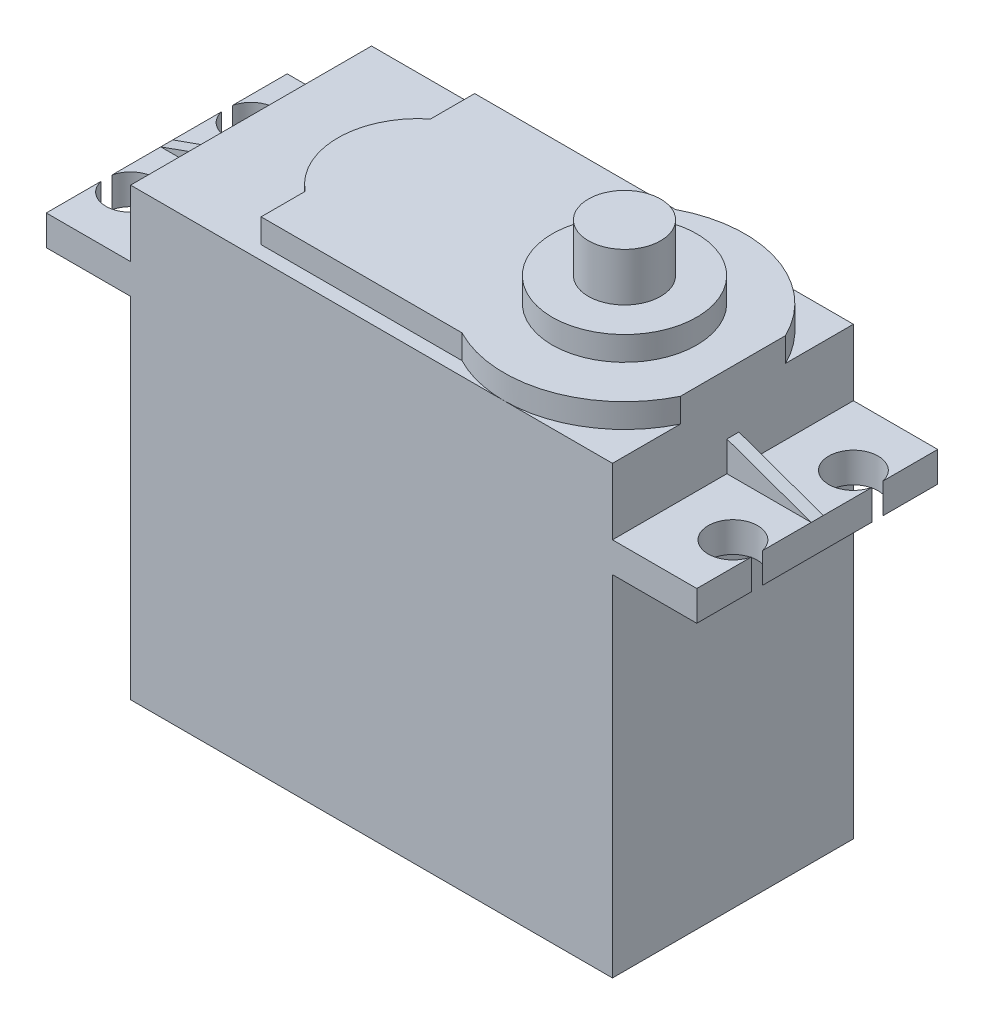
ISO-10303-21;
HEADER;
FILE_DESCRIPTION(('STEP AP214'),'2;1');
FILE_NAME('part.step','',(''),(''),'','','');
FILE_SCHEMA(('AUTOMOTIVE_DESIGN { 1 0 10303 214 1 1 1 1 }'));
ENDSEC;
DATA;
#1=APPLICATION_CONTEXT('core data for automotive mechanical design processes');
#2=APPLICATION_PROTOCOL_DEFINITION('international standard','automotive_design',2000,#1);
#3=PRODUCT_CONTEXT('',#1,'mechanical');
#4=PRODUCT('Part','Part','',(#3));
#5=PRODUCT_RELATED_PRODUCT_CATEGORY('part','',(#4));
#6=PRODUCT_DEFINITION_FORMATION('','',#4);
#7=PRODUCT_DEFINITION_CONTEXT('part definition',#1,'design');
#8=PRODUCT_DEFINITION('design','',#6,#7);
#9=PRODUCT_DEFINITION_SHAPE('','',#8);
#10=(LENGTH_UNIT() NAMED_UNIT(*) SI_UNIT(.MILLI.,.METRE.));
#11=(NAMED_UNIT(*) PLANE_ANGLE_UNIT() SI_UNIT($,.RADIAN.));
#12=(NAMED_UNIT(*) SI_UNIT($,.STERADIAN.) SOLID_ANGLE_UNIT());
#13=UNCERTAINTY_MEASURE_WITH_UNIT(LENGTH_MEASURE(1.E-05),#10,'distance_accuracy_value','');
#14=(GEOMETRIC_REPRESENTATION_CONTEXT(3) GLOBAL_UNCERTAINTY_ASSIGNED_CONTEXT((#13)) GLOBAL_UNIT_ASSIGNED_CONTEXT((#10,
#11,#12)) REPRESENTATION_CONTEXT('',''));
#15=CARTESIAN_POINT('',(0.,0.,0.));
#16=DIRECTION('',(0.,0.,1.));
#17=DIRECTION('',(1.,0.,0.));
#18=AXIS2_PLACEMENT_3D('',#15,#16,#17);
#19=CARTESIAN_POINT('',(0.,31.5,0.));
#20=DIRECTION('',(0.,-1.,0.));
#21=DIRECTION('',(0.,0.,-1.));
#22=AXIS2_PLACEMENT_3D('',#19,#20,#21);
#23=PLANE('',#22);
#24=DIRECTION('',(1.,0.,0.));
#25=VECTOR('',#24,1.);
#26=CARTESIAN_POINT('',(27.,31.5,0.5));
#27=LINE('',#26,#25);
#28=CARTESIAN_POINT('',(20.,31.5,0.5));
#29=VERTEX_POINT('',#28);
#30=CARTESIAN_POINT('',(27.,31.5,0.5));
#31=VERTEX_POINT('',#30);
#32=EDGE_CURVE('E284',#29,#31,#27,.T.);
#33=ORIENTED_EDGE('',*,*,#32,.F.);
#34=DIRECTION('',(0.,0.,-1.));
#35=VECTOR('',#34,1.);
#36=CARTESIAN_POINT('',(20.,31.5,10.));
#37=LINE('',#36,#35);
#38=CARTESIAN_POINT('',(20.,31.5,10.));
#39=VERTEX_POINT('',#38);
#40=EDGE_CURVE('E268',#39,#29,#37,.T.);
#41=ORIENTED_EDGE('',*,*,#40,.F.);
#42=DIRECTION('',(1.,0.,0.));
#43=VECTOR('',#42,1.);
#44=CARTESIAN_POINT('',(-27.,31.5,10.));
#45=LINE('',#44,#43);
#46=CARTESIAN_POINT('',(27.,31.5,10.));
#47=VERTEX_POINT('',#46);
#48=EDGE_CURVE('E533',#39,#47,#45,.T.);
#49=ORIENTED_EDGE('',*,*,#48,.T.);
#50=DIRECTION('',(0.,0.,-1.));
#51=VECTOR('',#50,1.);
#52=CARTESIAN_POINT('',(27.,31.5,10.));
#53=LINE('',#52,#51);
#54=CARTESIAN_POINT('',(27.,31.5,5.44999999999998));
#55=VERTEX_POINT('',#54);
#56=EDGE_CURVE('E518',#47,#55,#53,.T.);
#57=ORIENTED_EDGE('',*,*,#56,.T.);
#58=CARTESIAN_POINT('',(25.,31.5,5.));
#59=DIRECTION('',(0.,1.,0.));
#60=DIRECTION('',(0.,0.,1.));
#61=AXIS2_PLACEMENT_3D('',#58,#59,#60);
#62=CIRCLE('',#61,2.05);
#63=CARTESIAN_POINT('',(27.,31.5,4.55000000000002));
#64=VERTEX_POINT('',#63);
#65=EDGE_CURVE('E340',#64,#55,#62,.T.);
#66=ORIENTED_EDGE('',*,*,#65,.F.);
#67=EDGE_CURVE('E286',#64,#31,#53,.T.);
#68=ORIENTED_EDGE('',*,*,#67,.T.);
#69=EDGE_LOOP('',(#33,#41,#49,#57,#66,#68));
#70=FACE_BOUND('',#69,.T.);
#71=ADVANCED_FACE('F39',(#70),#23,.F.);
#72=DIRECTION('',(1.,0.,0.));
#73=VECTOR('',#72,1.);
#74=CARTESIAN_POINT('',(-27.,31.5,0.5));
#75=LINE('',#74,#73);
#76=CARTESIAN_POINT('',(-27.,31.5,0.5));
#77=VERTEX_POINT('',#76);
#78=CARTESIAN_POINT('',(-20.,31.5,0.5));
#79=VERTEX_POINT('',#78);
#80=EDGE_CURVE('E321',#77,#79,#75,.T.);
#81=ORIENTED_EDGE('',*,*,#80,.F.);
#82=DIRECTION('',(0.,0.,1.));
#83=VECTOR('',#82,1.);
#84=CARTESIAN_POINT('',(-27.,31.5,10.));
#85=LINE('',#84,#83);
#86=CARTESIAN_POINT('',(-27.,31.5,4.54999999999996));
#87=VERTEX_POINT('',#86);
#88=EDGE_CURVE('E535',#77,#87,#85,.T.);
#89=ORIENTED_EDGE('',*,*,#88,.T.);
#90=CARTESIAN_POINT('',(-25.,31.5,5.));
#91=DIRECTION('',(0.,1.,0.));
#92=DIRECTION('',(0.,0.,1.));
#93=AXIS2_PLACEMENT_3D('',#90,#91,#92);
#94=CIRCLE('',#93,2.05);
#95=CARTESIAN_POINT('',(-27.,31.5,5.45000000000004));
#96=VERTEX_POINT('',#95);
#97=EDGE_CURVE('E346',#96,#87,#94,.T.);
#98=ORIENTED_EDGE('',*,*,#97,.F.);
#99=CARTESIAN_POINT('',(-27.,31.5,10.));
#100=VERTEX_POINT('',#99);
#101=EDGE_CURVE('E528',#96,#100,#85,.T.);
#102=ORIENTED_EDGE('',*,*,#101,.T.);
#103=CARTESIAN_POINT('',(-20.,31.5,10.));
#104=VERTEX_POINT('',#103);
#105=EDGE_CURVE('E536',#100,#104,#45,.T.);
#106=ORIENTED_EDGE('',*,*,#105,.T.);
#107=DIRECTION('',(0.,0.,1.));
#108=VECTOR('',#107,1.);
#109=CARTESIAN_POINT('',(-20.,31.5,10.));
#110=LINE('',#109,#108);
#111=EDGE_CURVE('E280',#79,#104,#110,.T.);
#112=ORIENTED_EDGE('',*,*,#111,.F.);
#113=EDGE_LOOP('',(#81,#89,#98,#102,#106,#112));
#114=FACE_BOUND('',#113,.T.);
#115=ADVANCED_FACE('F693',(#114),#23,.F.);
#116=CARTESIAN_POINT('',(27.,31.5,10.));
#117=DIRECTION('',(-1.,0.,0.));
#118=DIRECTION('',(0.,0.,1.));
#119=AXIS2_PLACEMENT_3D('',#116,#117,#118);
#120=PLANE('',#119);
#121=DIRECTION('',(0.,0.,-1.));
#122=VECTOR('',#121,1.);
#123=CARTESIAN_POINT('',(27.,29.,10.));
#124=LINE('',#123,#122);
#125=CARTESIAN_POINT('',(27.,29.,4.55000000000002));
#126=VERTEX_POINT('',#125);
#127=CARTESIAN_POINT('',(27.,29.,-4.55000000000002));
#128=VERTEX_POINT('',#127);
#129=EDGE_CURVE('E546',#126,#128,#124,.T.);
#130=ORIENTED_EDGE('',*,*,#129,.T.);
#131=DIRECTION('',(0.,1.,0.));
#132=VECTOR('',#131,1.);
#133=CARTESIAN_POINT('',(27.,27.5,-4.55000000000002));
#134=LINE('',#133,#132);
#135=CARTESIAN_POINT('',(27.,31.5,-4.55000000000002));
#136=VERTEX_POINT('',#135);
#137=EDGE_CURVE('E11',#128,#136,#134,.T.);
#138=ORIENTED_EDGE('',*,*,#137,.T.);
#139=CARTESIAN_POINT('',(27.,31.5,-0.5));
#140=VERTEX_POINT('',#139);
#141=EDGE_CURVE('E523',#140,#136,#53,.T.);
#142=ORIENTED_EDGE('',*,*,#141,.F.);
#143=DIRECTION('',(0.,0.,1.));
#144=VECTOR('',#143,1.);
#145=CARTESIAN_POINT('',(27.,31.5,-0.5));
#146=LINE('',#145,#144);
#147=EDGE_CURVE('E62',#140,#31,#146,.T.);
#148=ORIENTED_EDGE('',*,*,#147,.T.);
#149=ORIENTED_EDGE('',*,*,#67,.F.);
#150=DIRECTION('',(0.,1.,0.));
#151=VECTOR('',#150,1.);
#152=CARTESIAN_POINT('',(27.,27.5,4.55000000000002));
#153=LINE('',#152,#151);
#154=EDGE_CURVE('E620',#64,#126,#153,.F.);
#155=ORIENTED_EDGE('',*,*,#154,.T.);
#156=EDGE_LOOP('',(#130,#138,#142,#148,#149,#155));
#157=FACE_BOUND('',#156,.T.);
#158=ADVANCED_FACE('F644',(#157),#120,.F.);
#159=CARTESIAN_POINT('',(27.,29.,10.));
#160=VERTEX_POINT('',#159);
#161=CARTESIAN_POINT('',(27.,29.,5.44999999999998));
#162=VERTEX_POINT('',#161);
#163=EDGE_CURVE('E541',#160,#162,#124,.T.);
#164=ORIENTED_EDGE('',*,*,#163,.T.);
#165=DIRECTION('',(0.,1.,0.));
#166=VECTOR('',#165,1.);
#167=CARTESIAN_POINT('',(27.,27.5,5.44999999999998));
#168=LINE('',#167,#166);
#169=EDGE_CURVE('E624',#162,#55,#168,.T.);
#170=ORIENTED_EDGE('',*,*,#169,.T.);
#171=ORIENTED_EDGE('',*,*,#56,.F.);
#172=DIRECTION('',(0.,-1.,0.));
#173=VECTOR('',#172,1.);
#174=CARTESIAN_POINT('',(27.,31.5,10.));
#175=LINE('',#174,#173);
#176=EDGE_CURVE('E540',#47,#160,#175,.T.);
#177=ORIENTED_EDGE('',*,*,#176,.T.);
#178=EDGE_LOOP('',(#164,#170,#171,#177));
#179=FACE_BOUND('',#178,.T.);
#180=ADVANCED_FACE('F650',(#179),#120,.F.);
#181=CARTESIAN_POINT('',(-27.,31.5,10.));
#182=DIRECTION('',(1.,0.,0.));
#183=DIRECTION('',(0.,0.,-1.));
#184=AXIS2_PLACEMENT_3D('',#181,#182,#183);
#185=PLANE('',#184);
#186=DIRECTION('',(0.,0.,1.));
#187=VECTOR('',#186,1.);
#188=CARTESIAN_POINT('',(-27.,29.,10.));
#189=LINE('',#188,#187);
#190=CARTESIAN_POINT('',(-27.,29.,-4.54999999999996));
#191=VERTEX_POINT('',#190);
#192=CARTESIAN_POINT('',(-27.,29.,4.54999999999996));
#193=VERTEX_POINT('',#192);
#194=EDGE_CURVE('E557',#191,#193,#189,.T.);
#195=ORIENTED_EDGE('',*,*,#194,.T.);
#196=DIRECTION('',(0.,1.,0.));
#197=VECTOR('',#196,1.);
#198=CARTESIAN_POINT('',(-27.,27.5,4.54999999999996));
#199=LINE('',#198,#197);
#200=EDGE_CURVE('E368',#193,#87,#199,.T.);
#201=ORIENTED_EDGE('',*,*,#200,.T.);
#202=ORIENTED_EDGE('',*,*,#88,.F.);
#203=DIRECTION('',(0.,0.,1.));
#204=VECTOR('',#203,1.);
#205=CARTESIAN_POINT('',(-27.,31.5,-0.5));
#206=LINE('',#205,#204);
#207=CARTESIAN_POINT('',(-27.,31.5,-0.5));
#208=VERTEX_POINT('',#207);
#209=EDGE_CURVE('E336',#208,#77,#206,.T.);
#210=ORIENTED_EDGE('',*,*,#209,.F.);
#211=CARTESIAN_POINT('',(-27.,31.5,-4.54999999999996));
#212=VERTEX_POINT('',#211);
#213=EDGE_CURVE('E534',#212,#208,#85,.T.);
#214=ORIENTED_EDGE('',*,*,#213,.F.);
#215=DIRECTION('',(0.,1.,0.));
#216=VECTOR('',#215,1.);
#217=CARTESIAN_POINT('',(-27.,27.5,-4.54999999999996));
#218=LINE('',#217,#216);
#219=EDGE_CURVE('E356',#212,#191,#218,.F.);
#220=ORIENTED_EDGE('',*,*,#219,.T.);
#221=EDGE_LOOP('',(#195,#201,#202,#210,#214,#220));
#222=FACE_BOUND('',#221,.T.);
#223=ADVANCED_FACE('F682',(#222),#185,.F.);
#224=CARTESIAN_POINT('',(-27.,29.,-10.));
#225=VERTEX_POINT('',#224);
#226=CARTESIAN_POINT('',(-27.,29.,-5.45000000000004));
#227=VERTEX_POINT('',#226);
#228=EDGE_CURVE('E552',#225,#227,#189,.T.);
#229=ORIENTED_EDGE('',*,*,#228,.T.);
#230=DIRECTION('',(0.,1.,0.));
#231=VECTOR('',#230,1.);
#232=CARTESIAN_POINT('',(-27.,27.5,-5.45000000000004));
#233=LINE('',#232,#231);
#234=CARTESIAN_POINT('',(-27.,31.5,-5.45000000000004));
#235=VERTEX_POINT('',#234);
#236=EDGE_CURVE('E360',#227,#235,#233,.T.);
#237=ORIENTED_EDGE('',*,*,#236,.T.);
#238=CARTESIAN_POINT('',(-27.,31.5,-10.));
#239=VERTEX_POINT('',#238);
#240=EDGE_CURVE('E529',#239,#235,#85,.T.);
#241=ORIENTED_EDGE('',*,*,#240,.F.);
#242=DIRECTION('',(0.,-1.,0.));
#243=VECTOR('',#242,1.);
#244=CARTESIAN_POINT('',(-27.,31.5,-10.));
#245=LINE('',#244,#243);
#246=EDGE_CURVE('E570',#239,#225,#245,.T.);
#247=ORIENTED_EDGE('',*,*,#246,.T.);
#248=EDGE_LOOP('',(#229,#237,#241,#247));
#249=FACE_BOUND('',#248,.T.);
#250=ADVANCED_FACE('F672',(#249),#185,.F.);
#251=CARTESIAN_POINT('',(0.,37.,0.));
#252=DIRECTION('',(0.,-1.,0.));
#253=DIRECTION('',(0.,0.,-1.));
#254=AXIS2_PLACEMENT_3D('',#251,#252,#253);
#255=PLANE('',#254);
#256=CARTESIAN_POINT('',(11.,37.,0.));
#257=DIRECTION('',(0.,1.,0.));
#258=DIRECTION('',(0.,0.,1.));
#259=AXIS2_PLACEMENT_3D('',#256,#257,#258);
#260=CIRCLE('',#259,10.);
#261=CARTESIAN_POINT('',(20.,37.,-4.35889894354069));
#262=VERTEX_POINT('',#261);
#263=CARTESIAN_POINT('',(11.,37.,-10.));
#264=VERTEX_POINT('',#263);
#265=EDGE_CURVE('E435',#262,#264,#260,.T.);
#266=ORIENTED_EDGE('',*,*,#265,.F.);
#267=DIRECTION('',(0.,0.,-1.));
#268=VECTOR('',#267,1.);
#269=CARTESIAN_POINT('',(20.,37.,10.));
#270=LINE('',#269,#268);
#271=CARTESIAN_POINT('',(20.,37.,-10.));
#272=VERTEX_POINT('',#271);
#273=EDGE_CURVE('E486',#262,#272,#270,.T.);
#274=ORIENTED_EDGE('',*,*,#273,.T.);
#275=DIRECTION('',(-1.,0.,0.));
#276=VECTOR('',#275,1.);
#277=CARTESIAN_POINT('',(-20.,37.,-10.));
#278=LINE('',#277,#276);
#279=EDGE_CURVE('E487',#272,#264,#278,.T.);
#280=ORIENTED_EDGE('',*,*,#279,.T.);
#281=EDGE_LOOP('',(#266,#274,#280));
#282=FACE_BOUND('',#281,.T.);
#283=ADVANCED_FACE('F718',(#282),#255,.F.);
#284=CARTESIAN_POINT('',(6.37053709616448,37.,-8.86386333502558));
#285=VERTEX_POINT('',#284);
#286=EDGE_CURVE('E388',#264,#285,#260,.T.);
#287=ORIENTED_EDGE('',*,*,#286,.F.);
#288=CARTESIAN_POINT('',(-20.,37.,-10.));
#289=VERTEX_POINT('',#288);
#290=EDGE_CURVE('E485',#264,#289,#278,.T.);
#291=ORIENTED_EDGE('',*,*,#290,.T.);
#292=DIRECTION('',(0.,0.,1.));
#293=VECTOR('',#292,1.);
#294=CARTESIAN_POINT('',(-20.,37.,10.));
#295=LINE('',#294,#293);
#296=CARTESIAN_POINT('',(-20.,37.,10.));
#297=VERTEX_POINT('',#296);
#298=EDGE_CURVE('E491',#289,#297,#295,.T.);
#299=ORIENTED_EDGE('',*,*,#298,.T.);
#300=DIRECTION('',(1.,0.,0.));
#301=VECTOR('',#300,1.);
#302=CARTESIAN_POINT('',(-20.,37.,10.));
#303=LINE('',#302,#301);
#304=CARTESIAN_POINT('',(11.,37.,10.));
#305=VERTEX_POINT('',#304);
#306=EDGE_CURVE('E495',#297,#305,#303,.T.);
#307=ORIENTED_EDGE('',*,*,#306,.T.);
#308=CARTESIAN_POINT('',(11.,37.,0.));
#309=DIRECTION('',(0.,1.,0.));
#310=DIRECTION('',(0.,0.,1.));
#311=AXIS2_PLACEMENT_3D('',#308,#309,#310);
#312=CIRCLE('',#311,10.);
#313=CARTESIAN_POINT('',(6.37053709616448,37.,8.86386333502558));
#314=VERTEX_POINT('',#313);
#315=EDGE_CURVE('E431',#314,#305,#312,.T.);
#316=ORIENTED_EDGE('',*,*,#315,.F.);
#317=DIRECTION('',(1.,0.,0.));
#318=VECTOR('',#317,1.);
#319=CARTESIAN_POINT('',(-10.302888496507,37.,8.86386333502558));
#320=LINE('',#319,#318);
#321=CARTESIAN_POINT('',(-10.302888496507,37.,8.86386333502558));
#322=VERTEX_POINT('',#321);
#323=EDGE_CURVE('E427',#322,#314,#320,.T.);
#324=ORIENTED_EDGE('',*,*,#323,.F.);
#325=DIRECTION('',(0.,0.,1.));
#326=VECTOR('',#325,1.);
#327=CARTESIAN_POINT('',(-10.302888496507,37.,8.86386333502558));
#328=LINE('',#327,#326);
#329=CARTESIAN_POINT('',(-10.302888496507,37.,5.20385854808896));
#330=VERTEX_POINT('',#329);
#331=EDGE_CURVE('E393',#330,#322,#328,.T.);
#332=ORIENTED_EDGE('',*,*,#331,.F.);
#333=CARTESIAN_POINT('',(-6.12604180873386,37.,0.));
#334=DIRECTION('',(0.,1.,0.));
#335=DIRECTION('',(0.,0.,1.));
#336=AXIS2_PLACEMENT_3D('',#333,#334,#335);
#337=CIRCLE('',#336,6.67279491979782);
#338=CARTESIAN_POINT('',(-10.302888496507,37.,-5.20385854808896));
#339=VERTEX_POINT('',#338);
#340=EDGE_CURVE('E402',#339,#330,#337,.T.);
#341=ORIENTED_EDGE('',*,*,#340,.F.);
#342=DIRECTION('',(0.,0.,1.));
#343=VECTOR('',#342,1.);
#344=CARTESIAN_POINT('',(-10.302888496507,37.,-5.20385854808896));
#345=LINE('',#344,#343);
#346=CARTESIAN_POINT('',(-10.302888496507,37.,-8.86386333502558));
#347=VERTEX_POINT('',#346);
#348=EDGE_CURVE('E444',#347,#339,#345,.T.);
#349=ORIENTED_EDGE('',*,*,#348,.F.);
#350=DIRECTION('',(-1.,0.,0.));
#351=VECTOR('',#350,1.);
#352=CARTESIAN_POINT('',(-10.302888496507,37.,-8.86386333502558));
#353=LINE('',#352,#351);
#354=EDGE_CURVE('E440',#285,#347,#353,.T.);
#355=ORIENTED_EDGE('',*,*,#354,.F.);
#356=EDGE_LOOP('',(#287,#291,#299,#307,#316,#324,#332,#341,#349,#355));
#357=FACE_BOUND('',#356,.T.);
#358=ADVANCED_FACE('F769',(#357),#255,.F.);
#359=CARTESIAN_POINT('',(20.,37.,4.35889894354068));
#360=VERTEX_POINT('',#359);
#361=EDGE_CURVE('E436',#305,#360,#312,.T.);
#362=ORIENTED_EDGE('',*,*,#361,.F.);
#363=CARTESIAN_POINT('',(20.,37.,10.));
#364=VERTEX_POINT('',#363);
#365=EDGE_CURVE('E494',#305,#364,#303,.T.);
#366=ORIENTED_EDGE('',*,*,#365,.T.);
#367=EDGE_CURVE('E482',#364,#360,#270,.T.);
#368=ORIENTED_EDGE('',*,*,#367,.T.);
#369=EDGE_LOOP('',(#362,#366,#368));
#370=FACE_BOUND('',#369,.T.);
#371=ADVANCED_FACE('F729',(#370),#255,.F.);
#372=CARTESIAN_POINT('',(20.,31.5,-0.5));
#373=VERTEX_POINT('',#372);
#374=CARTESIAN_POINT('',(20.,31.5,-10.));
#375=VERTEX_POINT('',#374);
#376=EDGE_CURVE('E281',#373,#375,#37,.T.);
#377=ORIENTED_EDGE('',*,*,#376,.F.);
#378=DIRECTION('',(1.,0.,0.));
#379=VECTOR('',#378,1.);
#380=CARTESIAN_POINT('',(27.,31.5,-0.5));
#381=LINE('',#380,#379);
#382=EDGE_CURVE('E55',#373,#140,#381,.T.);
#383=ORIENTED_EDGE('',*,*,#382,.T.);
#384=ORIENTED_EDGE('',*,*,#141,.T.);
#385=CARTESIAN_POINT('',(25.,31.5,-5.));
#386=DIRECTION('',(0.,1.,0.));
#387=DIRECTION('',(0.,0.,1.));
#388=AXIS2_PLACEMENT_3D('',#385,#386,#387);
#389=CIRCLE('',#388,2.05);
#390=CARTESIAN_POINT('',(27.,31.5,-5.44999999999998));
#391=VERTEX_POINT('',#390);
#392=EDGE_CURVE('E345',#391,#136,#389,.T.);
#393=ORIENTED_EDGE('',*,*,#392,.F.);
#394=CARTESIAN_POINT('',(27.,31.5,-10.));
#395=VERTEX_POINT('',#394);
#396=EDGE_CURVE('E562',#391,#395,#53,.T.);
#397=ORIENTED_EDGE('',*,*,#396,.T.);
#398=DIRECTION('',(-1.,0.,0.));
#399=VECTOR('',#398,1.);
#400=CARTESIAN_POINT('',(-27.,31.5,-10.));
#401=LINE('',#400,#399);
#402=EDGE_CURVE('E524',#395,#375,#401,.T.);
#403=ORIENTED_EDGE('',*,*,#402,.T.);
#404=EDGE_LOOP('',(#377,#383,#384,#393,#397,#403));
#405=FACE_BOUND('',#404,.T.);
#406=ADVANCED_FACE('F713',(#405),#23,.F.);
#407=ORIENTED_EDGE('',*,*,#213,.T.);
#408=DIRECTION('',(1.,0.,0.));
#409=VECTOR('',#408,1.);
#410=CARTESIAN_POINT('',(-27.,31.5,-0.5));
#411=LINE('',#410,#409);
#412=CARTESIAN_POINT('',(-20.,31.5,-0.5));
#413=VERTEX_POINT('',#412);
#414=EDGE_CURVE('E332',#208,#413,#411,.T.);
#415=ORIENTED_EDGE('',*,*,#414,.T.);
#416=CARTESIAN_POINT('',(-20.,31.5,-10.));
#417=VERTEX_POINT('',#416);
#418=EDGE_CURVE('E499',#417,#413,#110,.T.);
#419=ORIENTED_EDGE('',*,*,#418,.F.);
#420=EDGE_CURVE('E522',#417,#239,#401,.T.);
#421=ORIENTED_EDGE('',*,*,#420,.T.);
#422=ORIENTED_EDGE('',*,*,#240,.T.);
#423=CARTESIAN_POINT('',(-25.,31.5,-5.));
#424=DIRECTION('',(0.,1.,0.));
#425=DIRECTION('',(0.,0.,1.));
#426=AXIS2_PLACEMENT_3D('',#423,#424,#425);
#427=CIRCLE('',#426,2.05);
#428=EDGE_CURVE('E350',#212,#235,#427,.T.);
#429=ORIENTED_EDGE('',*,*,#428,.F.);
#430=EDGE_LOOP('',(#407,#415,#419,#421,#422,#429));
#431=FACE_BOUND('',#430,.T.);
#432=ADVANCED_FACE('F761',(#431),#23,.F.);
#433=CARTESIAN_POINT('',(20.,29.,10.));
#434=DIRECTION('',(-1.,0.,0.));
#435=DIRECTION('',(0.,0.,1.));
#436=AXIS2_PLACEMENT_3D('',#433,#434,#435);
#437=PLANE('',#436);
#438=DIRECTION('',(0.,0.,-1.));
#439=VECTOR('',#438,1.);
#440=CARTESIAN_POINT('',(20.,0.,10.));
#441=LINE('',#440,#439);
#442=CARTESIAN_POINT('',(20.,0.,10.));
#443=VERTEX_POINT('',#442);
#444=CARTESIAN_POINT('',(20.,0.,-10.));
#445=VERTEX_POINT('',#444);
#446=EDGE_CURVE('E578',#443,#445,#441,.T.);
#447=ORIENTED_EDGE('',*,*,#446,.T.);
#448=DIRECTION('',(0.,-1.,0.));
#449=VECTOR('',#448,1.);
#450=CARTESIAN_POINT('',(20.,29.,-10.));
#451=LINE('',#450,#449);
#452=CARTESIAN_POINT('',(20.,29.,-10.));
#453=VERTEX_POINT('',#452);
#454=EDGE_CURVE('E611',#453,#445,#451,.T.);
#455=ORIENTED_EDGE('',*,*,#454,.F.);
#456=DIRECTION('',(0.,0.,-1.));
#457=VECTOR('',#456,1.);
#458=CARTESIAN_POINT('',(20.,29.,10.));
#459=LINE('',#458,#457);
#460=CARTESIAN_POINT('',(20.,29.,10.));
#461=VERTEX_POINT('',#460);
#462=EDGE_CURVE('E579',#461,#453,#459,.T.);
#463=ORIENTED_EDGE('',*,*,#462,.F.);
#464=DIRECTION('',(0.,-1.,0.));
#465=VECTOR('',#464,1.);
#466=CARTESIAN_POINT('',(20.,29.,10.));
#467=LINE('',#466,#465);
#468=EDGE_CURVE('E588',#461,#443,#467,.T.);
#469=ORIENTED_EDGE('',*,*,#468,.T.);
#470=EDGE_LOOP('',(#447,#455,#463,#469));
#471=FACE_BOUND('',#470,.T.);
#472=ADVANCED_FACE('F41',(#471),#437,.F.);
#473=CARTESIAN_POINT('',(-20.,29.,-10.));
#474=DIRECTION('',(0.,0.,1.));
#475=DIRECTION('',(1.,0.,0.));
#476=AXIS2_PLACEMENT_3D('',#473,#474,#475);
#477=PLANE('',#476);
#478=DIRECTION('',(-1.,0.,0.));
#479=VECTOR('',#478,1.);
#480=CARTESIAN_POINT('',(-20.,0.,-10.));
#481=LINE('',#480,#479);
#482=CARTESIAN_POINT('',(-20.,0.,-10.));
#483=VERTEX_POINT('',#482);
#484=EDGE_CURVE('E592',#445,#483,#481,.T.);
#485=ORIENTED_EDGE('',*,*,#484,.T.);
#486=DIRECTION('',(0.,-1.,0.));
#487=VECTOR('',#486,1.);
#488=CARTESIAN_POINT('',(-20.,29.,-10.));
#489=LINE('',#488,#487);
#490=CARTESIAN_POINT('',(-20.,29.,-10.));
#491=VERTEX_POINT('',#490);
#492=EDGE_CURVE('E607',#491,#483,#489,.T.);
#493=ORIENTED_EDGE('',*,*,#492,.F.);
#494=DIRECTION('',(-1.,0.,0.));
#495=VECTOR('',#494,1.);
#496=CARTESIAN_POINT('',(-27.,29.,-10.));
#497=LINE('',#496,#495);
#498=EDGE_CURVE('E545',#491,#225,#497,.T.);
#499=ORIENTED_EDGE('',*,*,#498,.T.);
#500=ORIENTED_EDGE('',*,*,#246,.F.);
#501=ORIENTED_EDGE('',*,*,#420,.F.);
#502=DIRECTION('',(0.,-1.,0.));
#503=VECTOR('',#502,1.);
#504=CARTESIAN_POINT('',(-20.,37.,-10.));
#505=LINE('',#504,#503);
#506=EDGE_CURVE('E509',#289,#417,#505,.T.);
#507=ORIENTED_EDGE('',*,*,#506,.F.);
#508=ORIENTED_EDGE('',*,*,#290,.F.);
#509=ORIENTED_EDGE('',*,*,#279,.F.);
#510=DIRECTION('',(0.,-1.,0.));
#511=VECTOR('',#510,1.);
#512=CARTESIAN_POINT('',(20.,37.,-10.));
#513=LINE('',#512,#511);
#514=EDGE_CURVE('E513',#272,#375,#513,.T.);
#515=ORIENTED_EDGE('',*,*,#514,.T.);
#516=ORIENTED_EDGE('',*,*,#402,.F.);
#517=DIRECTION('',(0.,-1.,0.));
#518=VECTOR('',#517,1.);
#519=CARTESIAN_POINT('',(27.,31.5,-10.));
#520=LINE('',#519,#518);
#521=CARTESIAN_POINT('',(27.,29.,-10.));
#522=VERTEX_POINT('',#521);
#523=EDGE_CURVE('E574',#395,#522,#520,.T.);
#524=ORIENTED_EDGE('',*,*,#523,.T.);
#525=EDGE_CURVE('E547',#522,#453,#497,.T.);
#526=ORIENTED_EDGE('',*,*,#525,.T.);
#527=ORIENTED_EDGE('',*,*,#454,.T.);
#528=EDGE_LOOP('',(#485,#493,#499,#500,#501,#507,#508,#509,#515,#516,#524,#526,#527));
#529=FACE_BOUND('',#528,.T.);
#530=ADVANCED_FACE('F665',(#529),#477,.F.);
#531=CARTESIAN_POINT('',(-20.,29.,10.));
#532=DIRECTION('',(1.,0.,0.));
#533=DIRECTION('',(0.,0.,-1.));
#534=AXIS2_PLACEMENT_3D('',#531,#532,#533);
#535=PLANE('',#534);
#536=DIRECTION('',(0.,0.,1.));
#537=VECTOR('',#536,1.);
#538=CARTESIAN_POINT('',(-20.,0.,10.));
#539=LINE('',#538,#537);
#540=CARTESIAN_POINT('',(-20.,0.,10.));
#541=VERTEX_POINT('',#540);
#542=EDGE_CURVE('E595',#483,#541,#539,.T.);
#543=ORIENTED_EDGE('',*,*,#542,.T.);
#544=DIRECTION('',(0.,-1.,0.));
#545=VECTOR('',#544,1.);
#546=CARTESIAN_POINT('',(-20.,29.,10.));
#547=LINE('',#546,#545);
#548=CARTESIAN_POINT('',(-20.,29.,10.));
#549=VERTEX_POINT('',#548);
#550=EDGE_CURVE('E603',#549,#541,#547,.T.);
#551=ORIENTED_EDGE('',*,*,#550,.F.);
#552=DIRECTION('',(0.,0.,1.));
#553=VECTOR('',#552,1.);
#554=CARTESIAN_POINT('',(-20.,29.,10.));
#555=LINE('',#554,#553);
#556=EDGE_CURVE('E583',#491,#549,#555,.T.);
#557=ORIENTED_EDGE('',*,*,#556,.F.);
#558=ORIENTED_EDGE('',*,*,#492,.T.);
#559=EDGE_LOOP('',(#543,#551,#557,#558));
#560=FACE_BOUND('',#559,.T.);
#561=ADVANCED_FACE('F914',(#560),#535,.F.);
#562=CARTESIAN_POINT('',(-20.,29.,10.));
#563=DIRECTION('',(0.,0.,-1.));
#564=DIRECTION('',(-1.,0.,0.));
#565=AXIS2_PLACEMENT_3D('',#562,#563,#564);
#566=PLANE('',#565);
#567=DIRECTION('',(1.,0.,0.));
#568=VECTOR('',#567,1.);
#569=CARTESIAN_POINT('',(-20.,0.,10.));
#570=LINE('',#569,#568);
#571=EDGE_CURVE('E584',#541,#443,#570,.T.);
#572=ORIENTED_EDGE('',*,*,#571,.T.);
#573=ORIENTED_EDGE('',*,*,#468,.F.);
#574=DIRECTION('',(1.,0.,0.));
#575=VECTOR('',#574,1.);
#576=CARTESIAN_POINT('',(-27.,29.,10.));
#577=LINE('',#576,#575);
#578=EDGE_CURVE('E556',#461,#160,#577,.T.);
#579=ORIENTED_EDGE('',*,*,#578,.T.);
#580=ORIENTED_EDGE('',*,*,#176,.F.);
#581=ORIENTED_EDGE('',*,*,#48,.F.);
#582=DIRECTION('',(0.,-1.,0.));
#583=VECTOR('',#582,1.);
#584=CARTESIAN_POINT('',(20.,37.,10.));
#585=LINE('',#584,#583);
#586=EDGE_CURVE('E276',#364,#39,#585,.T.);
#587=ORIENTED_EDGE('',*,*,#586,.F.);
#588=ORIENTED_EDGE('',*,*,#365,.F.);
#589=ORIENTED_EDGE('',*,*,#306,.F.);
#590=DIRECTION('',(0.,-1.,0.));
#591=VECTOR('',#590,1.);
#592=CARTESIAN_POINT('',(-20.,37.,10.));
#593=LINE('',#592,#591);
#594=EDGE_CURVE('E505',#297,#104,#593,.T.);
#595=ORIENTED_EDGE('',*,*,#594,.T.);
#596=ORIENTED_EDGE('',*,*,#105,.F.);
#597=DIRECTION('',(0.,-1.,0.));
#598=VECTOR('',#597,1.);
#599=CARTESIAN_POINT('',(-27.,31.5,10.));
#600=LINE('',#599,#598);
#601=CARTESIAN_POINT('',(-27.,29.,10.));
#602=VERTEX_POINT('',#601);
#603=EDGE_CURVE('E566',#100,#602,#600,.T.);
#604=ORIENTED_EDGE('',*,*,#603,.T.);
#605=EDGE_CURVE('E558',#602,#549,#577,.T.);
#606=ORIENTED_EDGE('',*,*,#605,.T.);
#607=ORIENTED_EDGE('',*,*,#550,.T.);
#608=EDGE_LOOP('',(#572,#573,#579,#580,#581,#587,#588,#589,#595,#596,#604,#606,#607));
#609=FACE_BOUND('',#608,.T.);
#610=ADVANCED_FACE('F654',(#609),#566,.F.);
#611=CARTESIAN_POINT('',(0.,0.,0.));
#612=DIRECTION('',(0.,-1.,0.));
#613=DIRECTION('',(0.,0.,-1.));
#614=AXIS2_PLACEMENT_3D('',#611,#612,#613);
#615=PLANE('',#614);
#616=ORIENTED_EDGE('',*,*,#446,.F.);
#617=ORIENTED_EDGE('',*,*,#571,.F.);
#618=ORIENTED_EDGE('',*,*,#542,.F.);
#619=ORIENTED_EDGE('',*,*,#484,.F.);
#620=EDGE_LOOP('',(#616,#617,#618,#619));
#621=FACE_BOUND('',#620,.T.);
#622=ADVANCED_FACE('F794',(#621),#615,.T.);
#623=CARTESIAN_POINT('',(0.,29.,0.));
#624=DIRECTION('',(0.,-1.,0.));
#625=DIRECTION('',(0.,0.,-1.));
#626=AXIS2_PLACEMENT_3D('',#623,#624,#625);
#627=PLANE('',#626);
#628=CARTESIAN_POINT('',(25.,29.,-5.));
#629=DIRECTION('',(0.,-1.,0.));
#630=DIRECTION('',(0.,0.,-1.));
#631=AXIS2_PLACEMENT_3D('',#628,#629,#630);
#632=CIRCLE('',#631,2.05);
#633=CARTESIAN_POINT('',(27.,29.,-5.44999999999998));
#634=VERTEX_POINT('',#633);
#635=EDGE_CURVE('E375',#128,#634,#632,.T.);
#636=ORIENTED_EDGE('',*,*,#635,.F.);
#637=ORIENTED_EDGE('',*,*,#129,.F.);
#638=CARTESIAN_POINT('',(25.,29.,5.));
#639=DIRECTION('',(0.,-1.,0.));
#640=DIRECTION('',(0.,0.,-1.));
#641=AXIS2_PLACEMENT_3D('',#638,#639,#640);
#642=CIRCLE('',#641,2.05);
#643=EDGE_CURVE('E372',#162,#126,#642,.T.);
#644=ORIENTED_EDGE('',*,*,#643,.F.);
#645=ORIENTED_EDGE('',*,*,#163,.F.);
#646=ORIENTED_EDGE('',*,*,#578,.F.);
#647=ORIENTED_EDGE('',*,*,#462,.T.);
#648=ORIENTED_EDGE('',*,*,#525,.F.);
#649=EDGE_CURVE('E517',#634,#522,#124,.T.);
#650=ORIENTED_EDGE('',*,*,#649,.F.);
#651=EDGE_LOOP('',(#636,#637,#644,#645,#646,#647,#648,#650));
#652=FACE_BOUND('',#651,.T.);
#653=ADVANCED_FACE('F639',(#652),#627,.T.);
#654=ORIENTED_EDGE('',*,*,#396,.F.);
#655=DIRECTION('',(0.,1.,0.));
#656=VECTOR('',#655,1.);
#657=CARTESIAN_POINT('',(27.,27.5,-5.44999999999998));
#658=LINE('',#657,#656);
#659=EDGE_CURVE('E48',#391,#634,#658,.F.);
#660=ORIENTED_EDGE('',*,*,#659,.T.);
#661=ORIENTED_EDGE('',*,*,#649,.T.);
#662=ORIENTED_EDGE('',*,*,#523,.F.);
#663=EDGE_LOOP('',(#654,#660,#661,#662));
#664=FACE_BOUND('',#663,.T.);
#665=ADVANCED_FACE('F632',(#664),#120,.F.);
#666=ORIENTED_EDGE('',*,*,#101,.F.);
#667=DIRECTION('',(0.,1.,0.));
#668=VECTOR('',#667,1.);
#669=CARTESIAN_POINT('',(-27.,27.5,5.45000000000004));
#670=LINE('',#669,#668);
#671=CARTESIAN_POINT('',(-27.,29.,5.45000000000004));
#672=VERTEX_POINT('',#671);
#673=EDGE_CURVE('E364',#96,#672,#670,.F.);
#674=ORIENTED_EDGE('',*,*,#673,.T.);
#675=EDGE_CURVE('E551',#672,#602,#189,.T.);
#676=ORIENTED_EDGE('',*,*,#675,.T.);
#677=ORIENTED_EDGE('',*,*,#603,.F.);
#678=EDGE_LOOP('',(#666,#674,#676,#677));
#679=FACE_BOUND('',#678,.T.);
#680=ADVANCED_FACE('F697',(#679),#185,.F.);
#681=CARTESIAN_POINT('',(-25.,29.,5.));
#682=DIRECTION('',(0.,-1.,0.));
#683=DIRECTION('',(0.,0.,-1.));
#684=AXIS2_PLACEMENT_3D('',#681,#682,#683);
#685=CIRCLE('',#684,2.05);
#686=EDGE_CURVE('E617',#193,#672,#685,.T.);
#687=ORIENTED_EDGE('',*,*,#686,.F.);
#688=ORIENTED_EDGE('',*,*,#194,.F.);
#689=CARTESIAN_POINT('',(-25.,29.,-5.));
#690=DIRECTION('',(0.,-1.,0.));
#691=DIRECTION('',(0.,0.,-1.));
#692=AXIS2_PLACEMENT_3D('',#689,#690,#691);
#693=CIRCLE('',#692,2.05);
#694=EDGE_CURVE('E387',#227,#191,#693,.T.);
#695=ORIENTED_EDGE('',*,*,#694,.F.);
#696=ORIENTED_EDGE('',*,*,#228,.F.);
#697=ORIENTED_EDGE('',*,*,#498,.F.);
#698=ORIENTED_EDGE('',*,*,#556,.T.);
#699=ORIENTED_EDGE('',*,*,#605,.F.);
#700=ORIENTED_EDGE('',*,*,#675,.F.);
#701=EDGE_LOOP('',(#687,#688,#695,#696,#697,#698,#699,#700));
#702=FACE_BOUND('',#701,.T.);
#703=ADVANCED_FACE('F675',(#702),#627,.T.);
#704=CARTESIAN_POINT('',(20.,37.,10.));
#705=DIRECTION('',(-1.,0.,0.));
#706=DIRECTION('',(0.,0.,1.));
#707=AXIS2_PLACEMENT_3D('',#704,#705,#706);
#708=PLANE('',#707);
#709=DIRECTION('',(0.,0.,1.));
#710=VECTOR('',#709,1.);
#711=CARTESIAN_POINT('',(20.,34.,-0.5));
#712=LINE('',#711,#710);
#713=CARTESIAN_POINT('',(20.,34.,-0.5));
#714=VERTEX_POINT('',#713);
#715=CARTESIAN_POINT('',(20.,34.,0.5));
#716=VERTEX_POINT('',#715);
#717=EDGE_CURVE('E308',#714,#716,#712,.T.);
#718=ORIENTED_EDGE('',*,*,#717,.F.);
#719=DIRECTION('',(0.,-1.,0.));
#720=VECTOR('',#719,1.);
#721=CARTESIAN_POINT('',(20.,31.5,-0.5));
#722=LINE('',#721,#720);
#723=EDGE_CURVE('E305',#714,#373,#722,.T.);
#724=ORIENTED_EDGE('',*,*,#723,.T.);
#725=ORIENTED_EDGE('',*,*,#376,.T.);
#726=ORIENTED_EDGE('',*,*,#514,.F.);
#727=ORIENTED_EDGE('',*,*,#273,.F.);
#728=DIRECTION('',(0.,-1.,0.));
#729=VECTOR('',#728,1.);
#730=CARTESIAN_POINT('',(20.,39.,-4.35889894354069));
#731=LINE('',#730,#729);
#732=CARTESIAN_POINT('',(20.,39.,-4.35889894354069));
#733=VERTEX_POINT('',#732);
#734=EDGE_CURVE('E466',#733,#262,#731,.T.);
#735=ORIENTED_EDGE('',*,*,#734,.F.);
#736=DIRECTION('',(0.,0.,-1.));
#737=VECTOR('',#736,1.);
#738=CARTESIAN_POINT('',(20.,39.,4.35889894354069));
#739=LINE('',#738,#737);
#740=CARTESIAN_POINT('',(20.,39.,4.35889894354069));
#741=VERTEX_POINT('',#740);
#742=EDGE_CURVE('E408',#741,#733,#739,.T.);
#743=ORIENTED_EDGE('',*,*,#742,.F.);
#744=DIRECTION('',(0.,-1.,0.));
#745=VECTOR('',#744,1.);
#746=CARTESIAN_POINT('',(20.,39.,4.35889894354069));
#747=LINE('',#746,#745);
#748=EDGE_CURVE('E470',#741,#360,#747,.T.);
#749=ORIENTED_EDGE('',*,*,#748,.T.);
#750=ORIENTED_EDGE('',*,*,#367,.F.);
#751=ORIENTED_EDGE('',*,*,#586,.T.);
#752=ORIENTED_EDGE('',*,*,#40,.T.);
#753=DIRECTION('',(0.,-1.,0.));
#754=VECTOR('',#753,1.);
#755=CARTESIAN_POINT('',(20.,31.5,0.5));
#756=LINE('',#755,#754);
#757=EDGE_CURVE('E272',#716,#29,#756,.T.);
#758=ORIENTED_EDGE('',*,*,#757,.F.);
#759=EDGE_LOOP('',(#718,#724,#725,#726,#727,#735,#743,#749,#750,#751,#752,#758));
#760=FACE_BOUND('',#759,.T.);
#761=ADVANCED_FACE('F270',(#760),#708,.F.);
#762=CARTESIAN_POINT('',(-20.,37.,10.));
#763=DIRECTION('',(1.,0.,0.));
#764=DIRECTION('',(0.,0.,-1.));
#765=AXIS2_PLACEMENT_3D('',#762,#763,#764);
#766=PLANE('',#765);
#767=ORIENTED_EDGE('',*,*,#418,.T.);
#768=DIRECTION('',(0.,1.,0.));
#769=VECTOR('',#768,1.);
#770=CARTESIAN_POINT('',(-20.,31.5,-0.5));
#771=LINE('',#770,#769);
#772=CARTESIAN_POINT('',(-20.,34.,-0.5));
#773=VERTEX_POINT('',#772);
#774=EDGE_CURVE('E325',#413,#773,#771,.T.);
#775=ORIENTED_EDGE('',*,*,#774,.T.);
#776=DIRECTION('',(0.,0.,1.));
#777=VECTOR('',#776,1.);
#778=CARTESIAN_POINT('',(-20.,34.,-0.5));
#779=LINE('',#778,#777);
#780=CARTESIAN_POINT('',(-20.,34.,0.5));
#781=VERTEX_POINT('',#780);
#782=EDGE_CURVE('E335',#773,#781,#779,.T.);
#783=ORIENTED_EDGE('',*,*,#782,.T.);
#784=DIRECTION('',(0.,1.,0.));
#785=VECTOR('',#784,1.);
#786=CARTESIAN_POINT('',(-20.,31.5,0.5));
#787=LINE('',#786,#785);
#788=EDGE_CURVE('E311',#79,#781,#787,.T.);
#789=ORIENTED_EDGE('',*,*,#788,.F.);
#790=ORIENTED_EDGE('',*,*,#111,.T.);
#791=ORIENTED_EDGE('',*,*,#594,.F.);
#792=ORIENTED_EDGE('',*,*,#298,.F.);
#793=ORIENTED_EDGE('',*,*,#506,.T.);
#794=EDGE_LOOP('',(#767,#775,#783,#789,#790,#791,#792,#793));
#795=FACE_BOUND('',#794,.T.);
#796=ADVANCED_FACE('F705',(#795),#766,.F.);
#797=CARTESIAN_POINT('',(-10.302888496507,39.,8.86386333502558));
#798=DIRECTION('',(1.,0.,0.));
#799=DIRECTION('',(0.,0.,-1.));
#800=AXIS2_PLACEMENT_3D('',#797,#798,#799);
#801=PLANE('',#800);
#802=ORIENTED_EDGE('',*,*,#331,.T.);
#803=DIRECTION('',(0.,-1.,0.));
#804=VECTOR('',#803,1.);
#805=CARTESIAN_POINT('',(-10.302888496507,39.,8.86386333502558));
#806=LINE('',#805,#804);
#807=CARTESIAN_POINT('',(-10.302888496507,39.,8.86386333502558));
#808=VERTEX_POINT('',#807);
#809=EDGE_CURVE('E478',#808,#322,#806,.T.);
#810=ORIENTED_EDGE('',*,*,#809,.F.);
#811=DIRECTION('',(0.,0.,1.));
#812=VECTOR('',#811,1.);
#813=CARTESIAN_POINT('',(-10.302888496507,39.,8.86386333502558));
#814=LINE('',#813,#812);
#815=CARTESIAN_POINT('',(-10.302888496507,39.,5.20385854808896));
#816=VERTEX_POINT('',#815);
#817=EDGE_CURVE('E397',#816,#808,#814,.T.);
#818=ORIENTED_EDGE('',*,*,#817,.F.);
#819=DIRECTION('',(0.,-1.,0.));
#820=VECTOR('',#819,1.);
#821=CARTESIAN_POINT('',(-10.302888496507,39.,5.20385854808896));
#822=LINE('',#821,#820);
#823=EDGE_CURVE('E423',#816,#330,#822,.T.);
#824=ORIENTED_EDGE('',*,*,#823,.T.);
#825=EDGE_LOOP('',(#802,#810,#818,#824));
#826=FACE_BOUND('',#825,.T.);
#827=ADVANCED_FACE('F843',(#826),#801,.F.);
#828=CARTESIAN_POINT('',(-10.302888496507,39.,8.86386333502558));
#829=DIRECTION('',(0.,0.,-1.));
#830=DIRECTION('',(-1.,0.,0.));
#831=AXIS2_PLACEMENT_3D('',#828,#829,#830);
#832=PLANE('',#831);
#833=ORIENTED_EDGE('',*,*,#323,.T.);
#834=DIRECTION('',(0.,-1.,0.));
#835=VECTOR('',#834,1.);
#836=CARTESIAN_POINT('',(6.37053709616448,39.,8.86386333502558));
#837=LINE('',#836,#835);
#838=CARTESIAN_POINT('',(6.37053709616448,39.,8.86386333502558));
#839=VERTEX_POINT('',#838);
#840=EDGE_CURVE('E474',#839,#314,#837,.T.);
#841=ORIENTED_EDGE('',*,*,#840,.F.);
#842=DIRECTION('',(1.,0.,0.));
#843=VECTOR('',#842,1.);
#844=CARTESIAN_POINT('',(-10.302888496507,39.,8.86386333502558));
#845=LINE('',#844,#843);
#846=EDGE_CURVE('E401',#808,#839,#845,.T.);
#847=ORIENTED_EDGE('',*,*,#846,.F.);
#848=ORIENTED_EDGE('',*,*,#809,.T.);
#849=EDGE_LOOP('',(#833,#841,#847,#848));
#850=FACE_BOUND('',#849,.T.);
#851=ADVANCED_FACE('F1051',(#850),#832,.F.);
#852=CARTESIAN_POINT('',(11.,39.,0.));
#853=DIRECTION('',(0.,-1.,0.));
#854=DIRECTION('',(0.,0.,-1.));
#855=AXIS2_PLACEMENT_3D('',#852,#853,#854);
#856=CYLINDRICAL_SURFACE('',#855,10.);
#857=ORIENTED_EDGE('',*,*,#315,.T.);
#858=ORIENTED_EDGE('',*,*,#361,.T.);
#859=ORIENTED_EDGE('',*,*,#748,.F.);
#860=CARTESIAN_POINT('',(11.,39.,0.));
#861=DIRECTION('',(0.,1.,0.));
#862=DIRECTION('',(0.,0.,1.));
#863=AXIS2_PLACEMENT_3D('',#860,#861,#862);
#864=CIRCLE('',#863,10.);
#865=EDGE_CURVE('E405',#839,#741,#864,.T.);
#866=ORIENTED_EDGE('',*,*,#865,.F.);
#867=ORIENTED_EDGE('',*,*,#840,.T.);
#868=EDGE_LOOP('',(#857,#858,#859,#866,#867));
#869=FACE_BOUND('',#868,.T.);
#870=ADVANCED_FACE('F734',(#869),#856,.T.);
#871=CARTESIAN_POINT('',(11.,39.,0.));
#872=DIRECTION('',(0.,-1.,0.));
#873=DIRECTION('',(0.,0.,-1.));
#874=AXIS2_PLACEMENT_3D('',#871,#872,#873);
#875=CYLINDRICAL_SURFACE('',#874,10.);
#876=ORIENTED_EDGE('',*,*,#265,.T.);
#877=ORIENTED_EDGE('',*,*,#286,.T.);
#878=DIRECTION('',(0.,-1.,0.));
#879=VECTOR('',#878,1.);
#880=CARTESIAN_POINT('',(6.37053709616448,39.,-8.86386333502558));
#881=LINE('',#880,#879);
#882=CARTESIAN_POINT('',(6.37053709616448,39.,-8.86386333502558));
#883=VERTEX_POINT('',#882);
#884=EDGE_CURVE('E462',#883,#285,#881,.T.);
#885=ORIENTED_EDGE('',*,*,#884,.F.);
#886=CARTESIAN_POINT('',(11.,39.,0.));
#887=DIRECTION('',(0.,1.,0.));
#888=DIRECTION('',(0.,0.,1.));
#889=AXIS2_PLACEMENT_3D('',#886,#887,#888);
#890=CIRCLE('',#889,10.);
#891=EDGE_CURVE('E411',#733,#883,#890,.T.);
#892=ORIENTED_EDGE('',*,*,#891,.F.);
#893=ORIENTED_EDGE('',*,*,#734,.T.);
#894=EDGE_LOOP('',(#876,#877,#885,#892,#893));
#895=FACE_BOUND('',#894,.T.);
#896=ADVANCED_FACE('F721',(#895),#875,.T.);
#897=CARTESIAN_POINT('',(-10.302888496507,39.,-8.86386333502558));
#898=DIRECTION('',(0.,0.,1.));
#899=DIRECTION('',(1.,0.,0.));
#900=AXIS2_PLACEMENT_3D('',#897,#898,#899);
#901=PLANE('',#900);
#902=ORIENTED_EDGE('',*,*,#354,.T.);
#903=DIRECTION('',(0.,-1.,0.));
#904=VECTOR('',#903,1.);
#905=CARTESIAN_POINT('',(-10.302888496507,39.,-8.86386333502558));
#906=LINE('',#905,#904);
#907=CARTESIAN_POINT('',(-10.302888496507,39.,-8.86386333502558));
#908=VERTEX_POINT('',#907);
#909=EDGE_CURVE('E458',#908,#347,#906,.T.);
#910=ORIENTED_EDGE('',*,*,#909,.F.);
#911=DIRECTION('',(-1.,0.,0.));
#912=VECTOR('',#911,1.);
#913=CARTESIAN_POINT('',(-10.302888496507,39.,-8.86386333502558));
#914=LINE('',#913,#912);
#915=EDGE_CURVE('E414',#883,#908,#914,.T.);
#916=ORIENTED_EDGE('',*,*,#915,.F.);
#917=ORIENTED_EDGE('',*,*,#884,.T.);
#918=EDGE_LOOP('',(#902,#910,#916,#917));
#919=FACE_BOUND('',#918,.T.);
#920=ADVANCED_FACE('F1030',(#919),#901,.F.);
#921=CARTESIAN_POINT('',(-10.302888496507,39.,-5.20385854808896));
#922=DIRECTION('',(1.,0.,0.));
#923=DIRECTION('',(0.,0.,-1.));
#924=AXIS2_PLACEMENT_3D('',#921,#922,#923);
#925=PLANE('',#924);
#926=ORIENTED_EDGE('',*,*,#348,.T.);
#927=DIRECTION('',(0.,-1.,0.));
#928=VECTOR('',#927,1.);
#929=CARTESIAN_POINT('',(-10.302888496507,39.,-5.20385854808896));
#930=LINE('',#929,#928);
#931=CARTESIAN_POINT('',(-10.302888496507,39.,-5.20385854808896));
#932=VERTEX_POINT('',#931);
#933=EDGE_CURVE('E454',#932,#339,#930,.T.);
#934=ORIENTED_EDGE('',*,*,#933,.F.);
#935=DIRECTION('',(0.,0.,1.));
#936=VECTOR('',#935,1.);
#937=CARTESIAN_POINT('',(-10.302888496507,39.,-5.20385854808896));
#938=LINE('',#937,#936);
#939=EDGE_CURVE('E417',#908,#932,#938,.T.);
#940=ORIENTED_EDGE('',*,*,#939,.F.);
#941=ORIENTED_EDGE('',*,*,#909,.T.);
#942=EDGE_LOOP('',(#926,#934,#940,#941));
#943=FACE_BOUND('',#942,.T.);
#944=ADVANCED_FACE('F1022',(#943),#925,.F.);
#945=CARTESIAN_POINT('',(-6.12604180873386,39.,0.));
#946=DIRECTION('',(0.,-1.,0.));
#947=DIRECTION('',(0.,0.,-1.));
#948=AXIS2_PLACEMENT_3D('',#945,#946,#947);
#949=CYLINDRICAL_SURFACE('',#948,6.67279491979782);
#950=ORIENTED_EDGE('',*,*,#340,.T.);
#951=ORIENTED_EDGE('',*,*,#823,.F.);
#952=CARTESIAN_POINT('',(-6.12604180873386,39.,0.));
#953=DIRECTION('',(0.,1.,0.));
#954=DIRECTION('',(0.,0.,1.));
#955=AXIS2_PLACEMENT_3D('',#952,#953,#954);
#956=CIRCLE('',#955,6.67279491979782);
#957=EDGE_CURVE('E420',#932,#816,#956,.T.);
#958=ORIENTED_EDGE('',*,*,#957,.F.);
#959=ORIENTED_EDGE('',*,*,#933,.T.);
#960=EDGE_LOOP('',(#950,#951,#958,#959));
#961=FACE_BOUND('',#960,.T.);
#962=ADVANCED_FACE('F1014',(#961),#949,.T.);
#963=CARTESIAN_POINT('',(-6.12604180873386,39.,0.));
#964=DIRECTION('',(0.,1.,0.));
#965=DIRECTION('',(0.,0.,1.));
#966=AXIS2_PLACEMENT_3D('',#963,#964,#965);
#967=PLANE('',#966);
#968=CARTESIAN_POINT('',(11.,39.,0.));
#969=DIRECTION('',(0.,1.,0.));
#970=DIRECTION('',(0.,0.,1.));
#971=AXIS2_PLACEMENT_3D('',#968,#969,#970);
#972=CIRCLE('',#971,6.);
#973=CARTESIAN_POINT('',(11.,39.,6.));
#974=VERTEX_POINT('',#973);
#975=EDGE_CURVE('E382',#974,#974,#972,.T.);
#976=ORIENTED_EDGE('',*,*,#975,.F.);
#977=EDGE_LOOP('',(#976));
#978=FACE_BOUND('',#977,.T.);
#979=ORIENTED_EDGE('',*,*,#817,.T.);
#980=ORIENTED_EDGE('',*,*,#846,.T.);
#981=ORIENTED_EDGE('',*,*,#865,.T.);
#982=ORIENTED_EDGE('',*,*,#742,.T.);
#983=ORIENTED_EDGE('',*,*,#891,.T.);
#984=ORIENTED_EDGE('',*,*,#915,.T.);
#985=ORIENTED_EDGE('',*,*,#939,.T.);
#986=ORIENTED_EDGE('',*,*,#957,.T.);
#987=EDGE_LOOP('',(#979,#980,#981,#982,#983,#984,#985,#986));
#988=FACE_BOUND('',#987,.T.);
#989=ADVANCED_FACE('F1006',(#978,#988),#967,.T.);
#990=CARTESIAN_POINT('',(11.,41.,0.));
#991=DIRECTION('',(0.,-1.,0.));
#992=DIRECTION('',(0.,0.,-1.));
#993=AXIS2_PLACEMENT_3D('',#990,#991,#992);
#994=CYLINDRICAL_SURFACE('',#993,6.);
#995=CARTESIAN_POINT('',(11.,41.,0.));
#996=DIRECTION('',(0.,1.,0.));
#997=DIRECTION('',(0.,0.,1.));
#998=AXIS2_PLACEMENT_3D('',#995,#996,#997);
#999=CIRCLE('',#998,6.);
#1000=CARTESIAN_POINT('',(11.,41.,6.));
#1001=VERTEX_POINT('',#1000);
#1002=EDGE_CURVE('E389',#1001,#1001,#999,.T.);
#1003=ORIENTED_EDGE('',*,*,#1002,.F.);
#1004=EDGE_LOOP('',(#1003));
#1005=FACE_BOUND('',#1004,.T.);
#1006=ORIENTED_EDGE('',*,*,#975,.T.);
#1007=EDGE_LOOP('',(#1006));
#1008=FACE_BOUND('',#1007,.T.);
#1009=ADVANCED_FACE('F998',(#1005,#1008),#994,.T.);
#1010=CARTESIAN_POINT('',(11.,41.,0.));
#1011=DIRECTION('',(0.,1.,0.));
#1012=DIRECTION('',(0.,0.,1.));
#1013=AXIS2_PLACEMENT_3D('',#1010,#1011,#1012);
#1014=PLANE('',#1013);
#1015=CARTESIAN_POINT('',(11.,41.,0.));
#1016=DIRECTION('',(0.,1.,0.));
#1017=DIRECTION('',(0.,0.,1.));
#1018=AXIS2_PLACEMENT_3D('',#1015,#1016,#1017);
#1019=CIRCLE('',#1018,3.);
#1020=CARTESIAN_POINT('',(11.,41.,3.));
#1021=VERTEX_POINT('',#1020);
#1022=EDGE_CURVE('E383',#1021,#1021,#1019,.T.);
#1023=ORIENTED_EDGE('',*,*,#1022,.F.);
#1024=EDGE_LOOP('',(#1023));
#1025=FACE_BOUND('',#1024,.T.);
#1026=ORIENTED_EDGE('',*,*,#1002,.T.);
#1027=EDGE_LOOP('',(#1026));
#1028=FACE_BOUND('',#1027,.T.);
#1029=ADVANCED_FACE('F990',(#1025,#1028),#1014,.T.);
#1030=CARTESIAN_POINT('',(11.,45.,0.));
#1031=DIRECTION('',(0.,-1.,0.));
#1032=DIRECTION('',(0.,0.,-1.));
#1033=AXIS2_PLACEMENT_3D('',#1030,#1031,#1032);
#1034=CYLINDRICAL_SURFACE('',#1033,3.);
#1035=CARTESIAN_POINT('',(11.,45.,0.));
#1036=DIRECTION('',(0.,1.,0.));
#1037=DIRECTION('',(0.,0.,1.));
#1038=AXIS2_PLACEMENT_3D('',#1035,#1036,#1037);
#1039=CIRCLE('',#1038,3.);
#1040=CARTESIAN_POINT('',(11.,45.,3.));
#1041=VERTEX_POINT('',#1040);
#1042=EDGE_CURVE('E378',#1041,#1041,#1039,.T.);
#1043=ORIENTED_EDGE('',*,*,#1042,.F.);
#1044=EDGE_LOOP('',(#1043));
#1045=FACE_BOUND('',#1044,.T.);
#1046=ORIENTED_EDGE('',*,*,#1022,.T.);
#1047=EDGE_LOOP('',(#1046));
#1048=FACE_BOUND('',#1047,.T.);
#1049=ADVANCED_FACE('F982',(#1045,#1048),#1034,.T.);
#1050=CARTESIAN_POINT('',(11.,45.,0.));
#1051=DIRECTION('',(0.,1.,0.));
#1052=DIRECTION('',(0.,0.,1.));
#1053=AXIS2_PLACEMENT_3D('',#1050,#1051,#1052);
#1054=PLANE('',#1053);
#1055=ORIENTED_EDGE('',*,*,#1042,.T.);
#1056=EDGE_LOOP('',(#1055));
#1057=FACE_BOUND('',#1056,.T.);
#1058=ADVANCED_FACE('F907',(#1057),#1054,.T.);
#1059=CARTESIAN_POINT('',(-25.,27.5,-5.));
#1060=DIRECTION('',(0.,1.,0.));
#1061=DIRECTION('',(0.,0.,1.));
#1062=AXIS2_PLACEMENT_3D('',#1059,#1060,#1061);
#1063=CYLINDRICAL_SURFACE('',#1062,2.05);
#1064=ORIENTED_EDGE('',*,*,#694,.T.);
#1065=ORIENTED_EDGE('',*,*,#219,.F.);
#1066=ORIENTED_EDGE('',*,*,#428,.T.);
#1067=ORIENTED_EDGE('',*,*,#236,.F.);
#1068=EDGE_LOOP('',(#1064,#1065,#1066,#1067));
#1069=FACE_BOUND('',#1068,.T.);
#1070=ADVANCED_FACE('F678',(#1069),#1063,.F.);
#1071=CARTESIAN_POINT('',(-25.,27.5,5.));
#1072=DIRECTION('',(0.,1.,0.));
#1073=DIRECTION('',(0.,0.,1.));
#1074=AXIS2_PLACEMENT_3D('',#1071,#1072,#1073);
#1075=CYLINDRICAL_SURFACE('',#1074,2.05);
#1076=ORIENTED_EDGE('',*,*,#686,.T.);
#1077=ORIENTED_EDGE('',*,*,#673,.F.);
#1078=ORIENTED_EDGE('',*,*,#97,.T.);
#1079=ORIENTED_EDGE('',*,*,#200,.F.);
#1080=EDGE_LOOP('',(#1076,#1077,#1078,#1079));
#1081=FACE_BOUND('',#1080,.T.);
#1082=ADVANCED_FACE('F752',(#1081),#1075,.F.);
#1083=CARTESIAN_POINT('',(25.,27.5,5.));
#1084=DIRECTION('',(0.,1.,0.));
#1085=DIRECTION('',(0.,0.,1.));
#1086=AXIS2_PLACEMENT_3D('',#1083,#1084,#1085);
#1087=CYLINDRICAL_SURFACE('',#1086,2.05);
#1088=ORIENTED_EDGE('',*,*,#643,.T.);
#1089=ORIENTED_EDGE('',*,*,#154,.F.);
#1090=ORIENTED_EDGE('',*,*,#65,.T.);
#1091=ORIENTED_EDGE('',*,*,#169,.F.);
#1092=EDGE_LOOP('',(#1088,#1089,#1090,#1091));
#1093=FACE_BOUND('',#1092,.T.);
#1094=ADVANCED_FACE('F743',(#1093),#1087,.F.);
#1095=CARTESIAN_POINT('',(25.,27.5,-5.));
#1096=DIRECTION('',(0.,1.,0.));
#1097=DIRECTION('',(0.,0.,1.));
#1098=AXIS2_PLACEMENT_3D('',#1095,#1096,#1097);
#1099=CYLINDRICAL_SURFACE('',#1098,2.05);
#1100=ORIENTED_EDGE('',*,*,#635,.T.);
#1101=ORIENTED_EDGE('',*,*,#659,.F.);
#1102=ORIENTED_EDGE('',*,*,#392,.T.);
#1103=ORIENTED_EDGE('',*,*,#137,.F.);
#1104=EDGE_LOOP('',(#1100,#1101,#1102,#1103));
#1105=FACE_BOUND('',#1104,.T.);
#1106=ADVANCED_FACE('F740',(#1105),#1099,.F.);
#1107=CARTESIAN_POINT('',(-20.,34.,-0.5));
#1108=DIRECTION('',(-0.336336396998157,0.941741911594837,0.));
#1109=DIRECTION('',(-0.941741911594837,-0.336336396998157,0.));
#1110=AXIS2_PLACEMENT_3D('',#1107,#1108,#1109);
#1111=PLANE('',#1110);
#1112=ORIENTED_EDGE('',*,*,#209,.T.);
#1113=DIRECTION('',(-0.941741911594837,-0.336336396998157,0.));
#1114=VECTOR('',#1113,1.);
#1115=CARTESIAN_POINT('',(-20.,34.,0.5));
#1116=LINE('',#1115,#1114);
#1117=EDGE_CURVE('E317',#781,#77,#1116,.T.);
#1118=ORIENTED_EDGE('',*,*,#1117,.F.);
#1119=ORIENTED_EDGE('',*,*,#782,.F.);
#1120=DIRECTION('',(-0.941741911594837,-0.336336396998157,0.));
#1121=VECTOR('',#1120,1.);
#1122=CARTESIAN_POINT('',(-20.,34.,-0.5));
#1123=LINE('',#1122,#1121);
#1124=EDGE_CURVE('E328',#773,#208,#1123,.T.);
#1125=ORIENTED_EDGE('',*,*,#1124,.T.);
#1126=EDGE_LOOP('',(#1112,#1118,#1119,#1125));
#1127=FACE_BOUND('',#1126,.T.);
#1128=ADVANCED_FACE('F742',(#1127),#1111,.T.);
#1129=CARTESIAN_POINT('',(0.,0.,-0.5));
#1130=DIRECTION('',(0.,0.,-1.));
#1131=DIRECTION('',(-1.,0.,0.));
#1132=AXIS2_PLACEMENT_3D('',#1129,#1130,#1131);
#1133=PLANE('',#1132);
#1134=ORIENTED_EDGE('',*,*,#774,.F.);
#1135=ORIENTED_EDGE('',*,*,#414,.F.);
#1136=ORIENTED_EDGE('',*,*,#1124,.F.);
#1137=EDGE_LOOP('',(#1134,#1135,#1136));
#1138=FACE_BOUND('',#1137,.T.);
#1139=ADVANCED_FACE('F749',(#1138),#1133,.T.);
#1140=CARTESIAN_POINT('',(0.,0.,0.5));
#1141=DIRECTION('',(0.,0.,-1.));
#1142=DIRECTION('',(-1.,0.,0.));
#1143=AXIS2_PLACEMENT_3D('',#1140,#1141,#1142);
#1144=PLANE('',#1143);
#1145=ORIENTED_EDGE('',*,*,#788,.T.);
#1146=ORIENTED_EDGE('',*,*,#1117,.T.);
#1147=ORIENTED_EDGE('',*,*,#80,.T.);
#1148=EDGE_LOOP('',(#1145,#1146,#1147));
#1149=FACE_BOUND('',#1148,.T.);
#1150=ADVANCED_FACE('F860',(#1149),#1144,.F.);
#1151=CARTESIAN_POINT('',(20.,34.,-0.5));
#1152=DIRECTION('',(0.336336396998157,0.941741911594837,0.));
#1153=DIRECTION('',(-0.941741911594837,0.336336396998157,0.));
#1154=AXIS2_PLACEMENT_3D('',#1151,#1152,#1153);
#1155=PLANE('',#1154);
#1156=ORIENTED_EDGE('',*,*,#717,.T.);
#1157=DIRECTION('',(-0.941741911594837,0.336336396998157,0.));
#1158=VECTOR('',#1157,1.);
#1159=CARTESIAN_POINT('',(20.,34.,0.5));
#1160=LINE('',#1159,#1158);
#1161=EDGE_CURVE('E291',#31,#716,#1160,.T.);
#1162=ORIENTED_EDGE('',*,*,#1161,.F.);
#1163=ORIENTED_EDGE('',*,*,#147,.F.);
#1164=DIRECTION('',(-0.941741911594837,0.336336396998157,0.));
#1165=VECTOR('',#1164,1.);
#1166=CARTESIAN_POINT('',(20.,34.,-0.5));
#1167=LINE('',#1166,#1165);
#1168=EDGE_CURVE('E298',#140,#714,#1167,.T.);
#1169=ORIENTED_EDGE('',*,*,#1168,.T.);
#1170=EDGE_LOOP('',(#1156,#1162,#1163,#1169));
#1171=FACE_BOUND('',#1170,.T.);
#1172=ADVANCED_FACE('F870',(#1171),#1155,.T.);
#1173=CARTESIAN_POINT('',(0.,0.,-0.5));
#1174=DIRECTION('',(0.,0.,-1.));
#1175=DIRECTION('',(-1.,0.,0.));
#1176=AXIS2_PLACEMENT_3D('',#1173,#1174,#1175);
#1177=PLANE('',#1176);
#1178=ORIENTED_EDGE('',*,*,#382,.F.);
#1179=ORIENTED_EDGE('',*,*,#723,.F.);
#1180=ORIENTED_EDGE('',*,*,#1168,.F.);
#1181=EDGE_LOOP('',(#1178,#1179,#1180));
#1182=FACE_BOUND('',#1181,.T.);
#1183=ADVANCED_FACE('F880',(#1182),#1177,.T.);
#1184=CARTESIAN_POINT('',(0.,0.,0.5));
#1185=DIRECTION('',(0.,0.,-1.));
#1186=DIRECTION('',(-1.,0.,0.));
#1187=AXIS2_PLACEMENT_3D('',#1184,#1185,#1186);
#1188=PLANE('',#1187);
#1189=ORIENTED_EDGE('',*,*,#32,.T.);
#1190=ORIENTED_EDGE('',*,*,#1161,.T.);
#1191=ORIENTED_EDGE('',*,*,#757,.T.);
#1192=EDGE_LOOP('',(#1189,#1190,#1191));
#1193=FACE_BOUND('',#1192,.T.);
#1194=ADVANCED_FACE('F293',(#1193),#1188,.F.);
#1195=CLOSED_SHELL('',(#71,#115,#158,#180,#223,#250,#283,#358,#371,#406,#432,#472,#530,#561,
#610,#622,#653,#665,#680,#703,#761,#796,#827,#851,#870,#896,#920,#944,#962,#989,#1009,#1029,
#1049,#1058,#1070,#1082,#1094,#1106,#1128,#1139,#1150,#1172,#1183,#1194));
#1196=MANIFOLD_SOLID_BREP('B2',#1195);
#1197=ADVANCED_BREP_SHAPE_REPRESENTATION('',(#18,#1196),#14);
#1198=SHAPE_DEFINITION_REPRESENTATION(#9,#1197);
ENDSEC;
END-ISO-10303-21;
